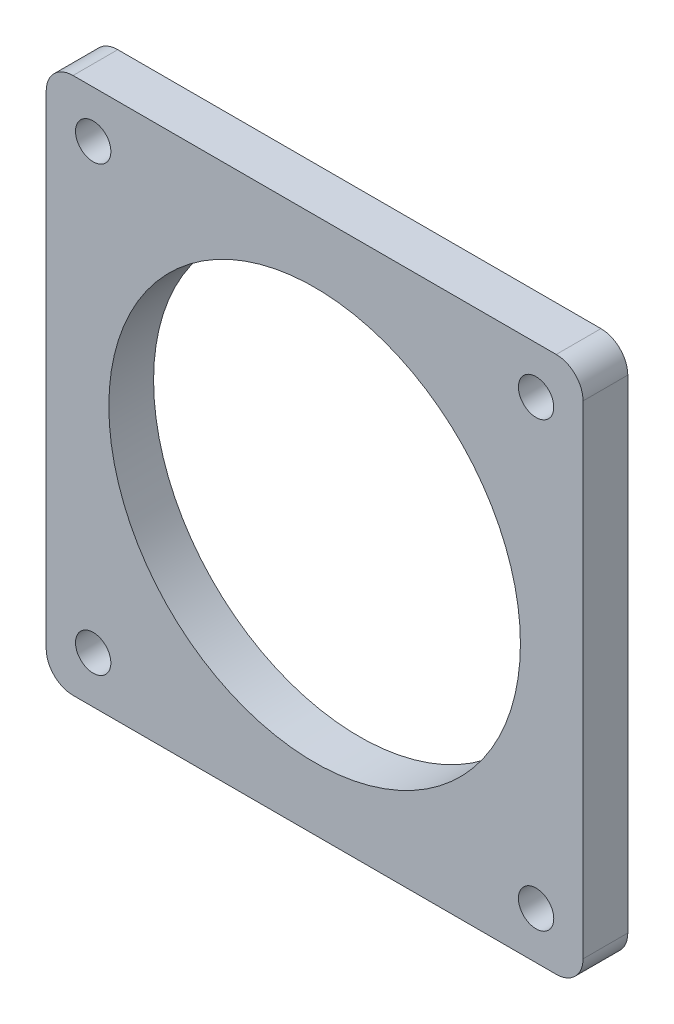
ISO-10303-21;
HEADER;
FILE_DESCRIPTION(('STEP AP214'),'2;1');
FILE_NAME('part.step','',(''),(''),'','','');
FILE_SCHEMA(('AUTOMOTIVE_DESIGN { 1 0 10303 214 1 1 1 1 }'));
ENDSEC;
DATA;
#1=APPLICATION_CONTEXT('core data for automotive mechanical design processes');
#2=APPLICATION_PROTOCOL_DEFINITION('international standard','automotive_design',2000,#1);
#3=PRODUCT_CONTEXT('',#1,'mechanical');
#4=PRODUCT('Part','Part','',(#3));
#5=PRODUCT_RELATED_PRODUCT_CATEGORY('part','',(#4));
#6=PRODUCT_DEFINITION_FORMATION('','',#4);
#7=PRODUCT_DEFINITION_CONTEXT('part definition',#1,'design');
#8=PRODUCT_DEFINITION('design','',#6,#7);
#9=PRODUCT_DEFINITION_SHAPE('','',#8);
#10=(LENGTH_UNIT() NAMED_UNIT(*) SI_UNIT(.MILLI.,.METRE.));
#11=(NAMED_UNIT(*) PLANE_ANGLE_UNIT() SI_UNIT($,.RADIAN.));
#12=(NAMED_UNIT(*) SI_UNIT($,.STERADIAN.) SOLID_ANGLE_UNIT());
#13=UNCERTAINTY_MEASURE_WITH_UNIT(LENGTH_MEASURE(1.E-05),#10,'distance_accuracy_value','');
#14=(GEOMETRIC_REPRESENTATION_CONTEXT(3) GLOBAL_UNCERTAINTY_ASSIGNED_CONTEXT((#13)) GLOBAL_UNIT_ASSIGNED_CONTEXT((#10,
#11,#12)) REPRESENTATION_CONTEXT('',''));
#15=CARTESIAN_POINT('',(0.,0.,0.));
#16=DIRECTION('',(0.,0.,1.));
#17=DIRECTION('',(1.,0.,0.));
#18=AXIS2_PLACEMENT_3D('',#15,#16,#17);
#19=CARTESIAN_POINT('',(27.,-27.,5.));
#20=DIRECTION('',(0.,0.,1.));
#21=DIRECTION('',(1.,0.,0.));
#22=AXIS2_PLACEMENT_3D('',#19,#20,#21);
#23=PLANE('',#22);
#24=CARTESIAN_POINT('',(24.75,-24.75,5.));
#25=DIRECTION('',(0.,0.,1.));
#26=DIRECTION('',(1.,0.,0.));
#27=AXIS2_PLACEMENT_3D('',#24,#25,#26);
#28=CIRCLE('',#27,1.975);
#29=CARTESIAN_POINT('',(26.725,-24.75,5.));
#30=VERTEX_POINT('',#29);
#31=EDGE_CURVE('E195',#30,#30,#28,.T.);
#32=ORIENTED_EDGE('',*,*,#31,.F.);
#33=EDGE_LOOP('',(#32));
#34=FACE_BOUND('',#33,.T.);
#35=CARTESIAN_POINT('',(-24.75,24.75,5.));
#36=DIRECTION('',(0.,0.,1.));
#37=DIRECTION('',(1.,0.,0.));
#38=AXIS2_PLACEMENT_3D('',#35,#36,#37);
#39=CIRCLE('',#38,1.975);
#40=CARTESIAN_POINT('',(-22.775,24.75,5.));
#41=VERTEX_POINT('',#40);
#42=EDGE_CURVE('E183',#41,#41,#39,.T.);
#43=ORIENTED_EDGE('',*,*,#42,.F.);
#44=EDGE_LOOP('',(#43));
#45=FACE_BOUND('',#44,.T.);
#46=CARTESIAN_POINT('',(27.,-27.,5.));
#47=DIRECTION('',(0.,0.,1.));
#48=DIRECTION('',(1.,0.,0.));
#49=AXIS2_PLACEMENT_3D('',#46,#47,#48);
#50=CIRCLE('',#49,3.);
#51=CARTESIAN_POINT('',(27.,-30.,5.));
#52=VERTEX_POINT('',#51);
#53=CARTESIAN_POINT('',(30.,-27.,5.));
#54=VERTEX_POINT('',#53);
#55=EDGE_CURVE('E146',#52,#54,#50,.T.);
#56=ORIENTED_EDGE('',*,*,#55,.T.);
#57=DIRECTION('',(0.,1.,0.));
#58=VECTOR('',#57,1.);
#59=CARTESIAN_POINT('',(30.,27.,5.));
#60=LINE('',#59,#58);
#61=CARTESIAN_POINT('',(30.,27.,5.));
#62=VERTEX_POINT('',#61);
#63=EDGE_CURVE('E94',#54,#62,#60,.T.);
#64=ORIENTED_EDGE('',*,*,#63,.T.);
#65=CARTESIAN_POINT('',(27.,27.,5.));
#66=DIRECTION('',(0.,0.,1.));
#67=DIRECTION('',(-1.,0.,0.));
#68=AXIS2_PLACEMENT_3D('',#65,#66,#67);
#69=CIRCLE('',#68,3.);
#70=CARTESIAN_POINT('',(27.,30.,5.));
#71=VERTEX_POINT('',#70);
#72=EDGE_CURVE('E161',#62,#71,#69,.T.);
#73=ORIENTED_EDGE('',*,*,#72,.T.);
#74=DIRECTION('',(-1.,0.,0.));
#75=VECTOR('',#74,1.);
#76=CARTESIAN_POINT('',(-27.,30.,5.));
#77=LINE('',#76,#75);
#78=CARTESIAN_POINT('',(-27.,30.,5.));
#79=VERTEX_POINT('',#78);
#80=EDGE_CURVE('E174',#71,#79,#77,.T.);
#81=ORIENTED_EDGE('',*,*,#80,.T.);
#82=CARTESIAN_POINT('',(-27.,27.,5.));
#83=DIRECTION('',(0.,0.,1.));
#84=DIRECTION('',(1.,0.,0.));
#85=AXIS2_PLACEMENT_3D('',#82,#83,#84);
#86=CIRCLE('',#85,3.);
#87=CARTESIAN_POINT('',(-30.,27.,5.));
#88=VERTEX_POINT('',#87);
#89=EDGE_CURVE('E113',#79,#88,#86,.T.);
#90=ORIENTED_EDGE('',*,*,#89,.T.);
#91=DIRECTION('',(0.,-1.,0.));
#92=VECTOR('',#91,1.);
#93=CARTESIAN_POINT('',(-30.,27.,5.));
#94=LINE('',#93,#92);
#95=CARTESIAN_POINT('',(-30.,-27.,5.));
#96=VERTEX_POINT('',#95);
#97=EDGE_CURVE('E107',#88,#96,#94,.T.);
#98=ORIENTED_EDGE('',*,*,#97,.T.);
#99=CARTESIAN_POINT('',(-27.,-27.,5.));
#100=DIRECTION('',(0.,0.,1.));
#101=DIRECTION('',(1.,0.,0.));
#102=AXIS2_PLACEMENT_3D('',#99,#100,#101);
#103=CIRCLE('',#102,3.);
#104=CARTESIAN_POINT('',(-27.,-30.,5.));
#105=VERTEX_POINT('',#104);
#106=EDGE_CURVE('E111',#96,#105,#103,.T.);
#107=ORIENTED_EDGE('',*,*,#106,.T.);
#108=DIRECTION('',(1.,0.,0.));
#109=VECTOR('',#108,1.);
#110=CARTESIAN_POINT('',(-27.,-30.,5.));
#111=LINE('',#110,#109);
#112=EDGE_CURVE('E51',#105,#52,#111,.T.);
#113=ORIENTED_EDGE('',*,*,#112,.T.);
#114=EDGE_LOOP('',(#56,#64,#73,#81,#90,#98,#107,#113));
#115=FACE_BOUND('',#114,.T.);
#116=CARTESIAN_POINT('',(0.,0.,5.));
#117=DIRECTION('',(0.,0.,1.));
#118=DIRECTION('',(1.,0.,0.));
#119=AXIS2_PLACEMENT_3D('',#116,#117,#118);
#120=CIRCLE('',#119,23.);
#121=CARTESIAN_POINT('',(23.,0.,5.));
#122=VERTEX_POINT('',#121);
#123=EDGE_CURVE('E135',#122,#122,#120,.T.);
#124=ORIENTED_EDGE('',*,*,#123,.F.);
#125=EDGE_LOOP('',(#124));
#126=FACE_BOUND('',#125,.T.);
#127=CARTESIAN_POINT('',(24.75,24.75,5.));
#128=DIRECTION('',(0.,0.,1.));
#129=DIRECTION('',(-1.,0.,0.));
#130=AXIS2_PLACEMENT_3D('',#127,#128,#129);
#131=CIRCLE('',#130,1.975);
#132=CARTESIAN_POINT('',(22.775,24.75,5.));
#133=VERTEX_POINT('',#132);
#134=EDGE_CURVE('E189',#133,#133,#131,.T.);
#135=ORIENTED_EDGE('',*,*,#134,.F.);
#136=EDGE_LOOP('',(#135));
#137=FACE_BOUND('',#136,.T.);
#138=CARTESIAN_POINT('',(-24.75,-24.75,5.));
#139=DIRECTION('',(0.,0.,1.));
#140=DIRECTION('',(-1.,0.,0.));
#141=AXIS2_PLACEMENT_3D('',#138,#139,#140);
#142=CIRCLE('',#141,1.975);
#143=CARTESIAN_POINT('',(-26.725,-24.75,5.));
#144=VERTEX_POINT('',#143);
#145=EDGE_CURVE('E201',#144,#144,#142,.T.);
#146=ORIENTED_EDGE('',*,*,#145,.F.);
#147=EDGE_LOOP('',(#146));
#148=FACE_BOUND('',#147,.T.);
#149=ADVANCED_FACE('F34',(#34,#45,#115,#126,#137,#148),#23,.T.);
#150=CARTESIAN_POINT('',(27.,-27.,0.));
#151=DIRECTION('',(0.,0.,1.));
#152=DIRECTION('',(1.,0.,0.));
#153=AXIS2_PLACEMENT_3D('',#150,#151,#152);
#154=PLANE('',#153);
#155=CARTESIAN_POINT('',(27.,-27.,0.));
#156=DIRECTION('',(0.,0.,1.));
#157=DIRECTION('',(1.,0.,0.));
#158=AXIS2_PLACEMENT_3D('',#155,#156,#157);
#159=CIRCLE('',#158,3.);
#160=CARTESIAN_POINT('',(27.,-30.,0.));
#161=VERTEX_POINT('',#160);
#162=CARTESIAN_POINT('',(30.,-27.,0.));
#163=VERTEX_POINT('',#162);
#164=EDGE_CURVE('E131',#161,#163,#159,.T.);
#165=ORIENTED_EDGE('',*,*,#164,.F.);
#166=DIRECTION('',(1.,0.,0.));
#167=VECTOR('',#166,1.);
#168=CARTESIAN_POINT('',(-27.,-30.,0.));
#169=LINE('',#168,#167);
#170=CARTESIAN_POINT('',(-27.,-30.,0.));
#171=VERTEX_POINT('',#170);
#172=EDGE_CURVE('E86',#171,#161,#169,.T.);
#173=ORIENTED_EDGE('',*,*,#172,.F.);
#174=CARTESIAN_POINT('',(-27.,-27.,0.));
#175=DIRECTION('',(0.,0.,1.));
#176=DIRECTION('',(1.,0.,0.));
#177=AXIS2_PLACEMENT_3D('',#174,#175,#176);
#178=CIRCLE('',#177,3.);
#179=CARTESIAN_POINT('',(-30.,-27.,0.));
#180=VERTEX_POINT('',#179);
#181=EDGE_CURVE('E80',#180,#171,#178,.T.);
#182=ORIENTED_EDGE('',*,*,#181,.F.);
#183=DIRECTION('',(0.,-1.,0.));
#184=VECTOR('',#183,1.);
#185=CARTESIAN_POINT('',(-30.,27.,0.));
#186=LINE('',#185,#184);
#187=CARTESIAN_POINT('',(-30.,27.,0.));
#188=VERTEX_POINT('',#187);
#189=EDGE_CURVE('E121',#188,#180,#186,.T.);
#190=ORIENTED_EDGE('',*,*,#189,.F.);
#191=CARTESIAN_POINT('',(-27.,27.,0.));
#192=DIRECTION('',(0.,0.,1.));
#193=DIRECTION('',(1.,0.,0.));
#194=AXIS2_PLACEMENT_3D('',#191,#192,#193);
#195=CIRCLE('',#194,3.);
#196=CARTESIAN_POINT('',(-27.,30.,0.));
#197=VERTEX_POINT('',#196);
#198=EDGE_CURVE('E141',#197,#188,#195,.T.);
#199=ORIENTED_EDGE('',*,*,#198,.F.);
#200=DIRECTION('',(-1.,0.,0.));
#201=VECTOR('',#200,1.);
#202=CARTESIAN_POINT('',(-27.,30.,0.));
#203=LINE('',#202,#201);
#204=CARTESIAN_POINT('',(27.,30.,0.));
#205=VERTEX_POINT('',#204);
#206=EDGE_CURVE('E139',#205,#197,#203,.T.);
#207=ORIENTED_EDGE('',*,*,#206,.F.);
#208=CARTESIAN_POINT('',(27.,27.,0.));
#209=DIRECTION('',(0.,0.,1.));
#210=DIRECTION('',(-1.,0.,0.));
#211=AXIS2_PLACEMENT_3D('',#208,#209,#210);
#212=CIRCLE('',#211,3.);
#213=CARTESIAN_POINT('',(30.,27.,0.));
#214=VERTEX_POINT('',#213);
#215=EDGE_CURVE('E137',#214,#205,#212,.T.);
#216=ORIENTED_EDGE('',*,*,#215,.F.);
#217=DIRECTION('',(0.,1.,0.));
#218=VECTOR('',#217,1.);
#219=CARTESIAN_POINT('',(30.,27.,0.));
#220=LINE('',#219,#218);
#221=EDGE_CURVE('E134',#163,#214,#220,.T.);
#222=ORIENTED_EDGE('',*,*,#221,.F.);
#223=EDGE_LOOP('',(#165,#173,#182,#190,#199,#207,#216,#222));
#224=FACE_BOUND('',#223,.T.);
#225=CARTESIAN_POINT('',(0.,0.,0.));
#226=DIRECTION('',(0.,0.,1.));
#227=DIRECTION('',(1.,0.,0.));
#228=AXIS2_PLACEMENT_3D('',#225,#226,#227);
#229=CIRCLE('',#228,23.);
#230=CARTESIAN_POINT('',(23.,0.,0.));
#231=VERTEX_POINT('',#230);
#232=EDGE_CURVE('E180',#231,#231,#229,.T.);
#233=ORIENTED_EDGE('',*,*,#232,.T.);
#234=EDGE_LOOP('',(#233));
#235=FACE_BOUND('',#234,.T.);
#236=CARTESIAN_POINT('',(-24.75,24.75,0.));
#237=DIRECTION('',(0.,0.,1.));
#238=DIRECTION('',(1.,0.,0.));
#239=AXIS2_PLACEMENT_3D('',#236,#237,#238);
#240=CIRCLE('',#239,1.975);
#241=CARTESIAN_POINT('',(-22.775,24.75,0.));
#242=VERTEX_POINT('',#241);
#243=EDGE_CURVE('E186',#242,#242,#240,.T.);
#244=ORIENTED_EDGE('',*,*,#243,.T.);
#245=EDGE_LOOP('',(#244));
#246=FACE_BOUND('',#245,.T.);
#247=CARTESIAN_POINT('',(24.75,24.75,0.));
#248=DIRECTION('',(0.,0.,1.));
#249=DIRECTION('',(-1.,0.,0.));
#250=AXIS2_PLACEMENT_3D('',#247,#248,#249);
#251=CIRCLE('',#250,1.975);
#252=CARTESIAN_POINT('',(22.775,24.75,0.));
#253=VERTEX_POINT('',#252);
#254=EDGE_CURVE('E192',#253,#253,#251,.T.);
#255=ORIENTED_EDGE('',*,*,#254,.T.);
#256=EDGE_LOOP('',(#255));
#257=FACE_BOUND('',#256,.T.);
#258=CARTESIAN_POINT('',(24.75,-24.75,0.));
#259=DIRECTION('',(0.,0.,1.));
#260=DIRECTION('',(1.,0.,0.));
#261=AXIS2_PLACEMENT_3D('',#258,#259,#260);
#262=CIRCLE('',#261,1.975);
#263=CARTESIAN_POINT('',(26.725,-24.75,0.));
#264=VERTEX_POINT('',#263);
#265=EDGE_CURVE('E198',#264,#264,#262,.T.);
#266=ORIENTED_EDGE('',*,*,#265,.T.);
#267=EDGE_LOOP('',(#266));
#268=FACE_BOUND('',#267,.T.);
#269=CARTESIAN_POINT('',(-24.75,-24.75,0.));
#270=DIRECTION('',(0.,0.,1.));
#271=DIRECTION('',(-1.,0.,0.));
#272=AXIS2_PLACEMENT_3D('',#269,#270,#271);
#273=CIRCLE('',#272,1.975);
#274=CARTESIAN_POINT('',(-26.725,-24.75,0.));
#275=VERTEX_POINT('',#274);
#276=EDGE_CURVE('E204',#275,#275,#273,.T.);
#277=ORIENTED_EDGE('',*,*,#276,.T.);
#278=EDGE_LOOP('',(#277));
#279=FACE_BOUND('',#278,.T.);
#280=ADVANCED_FACE('F165',(#224,#235,#246,#257,#268,#279),#154,.F.);
#281=CARTESIAN_POINT('',(27.,-27.,5.));
#282=DIRECTION('',(0.,0.,-1.));
#283=DIRECTION('',(-1.,0.,0.));
#284=AXIS2_PLACEMENT_3D('',#281,#282,#283);
#285=CYLINDRICAL_SURFACE('',#284,3.);
#286=ORIENTED_EDGE('',*,*,#164,.T.);
#287=DIRECTION('',(0.,0.,-1.));
#288=VECTOR('',#287,1.);
#289=CARTESIAN_POINT('',(30.,-27.,5.));
#290=LINE('',#289,#288);
#291=EDGE_CURVE('E11',#54,#163,#290,.T.);
#292=ORIENTED_EDGE('',*,*,#291,.F.);
#293=ORIENTED_EDGE('',*,*,#55,.F.);
#294=DIRECTION('',(0.,0.,-1.));
#295=VECTOR('',#294,1.);
#296=CARTESIAN_POINT('',(27.,-30.,5.));
#297=LINE('',#296,#295);
#298=EDGE_CURVE('E127',#52,#161,#297,.T.);
#299=ORIENTED_EDGE('',*,*,#298,.T.);
#300=EDGE_LOOP('',(#286,#292,#293,#299));
#301=FACE_BOUND('',#300,.T.);
#302=ADVANCED_FACE('F36',(#301),#285,.T.);
#303=CARTESIAN_POINT('',(30.,27.,5.));
#304=DIRECTION('',(-1.,0.,0.));
#305=DIRECTION('',(0.,-1.,0.));
#306=AXIS2_PLACEMENT_3D('',#303,#304,#305);
#307=PLANE('',#306);
#308=ORIENTED_EDGE('',*,*,#221,.T.);
#309=DIRECTION('',(0.,0.,-1.));
#310=VECTOR('',#309,1.);
#311=CARTESIAN_POINT('',(30.,27.,5.));
#312=LINE('',#311,#310);
#313=EDGE_CURVE('E43',#62,#214,#312,.T.);
#314=ORIENTED_EDGE('',*,*,#313,.F.);
#315=ORIENTED_EDGE('',*,*,#63,.F.);
#316=ORIENTED_EDGE('',*,*,#291,.T.);
#317=EDGE_LOOP('',(#308,#314,#315,#316));
#318=FACE_BOUND('',#317,.T.);
#319=ADVANCED_FACE('F238',(#318),#307,.F.);
#320=CARTESIAN_POINT('',(27.,27.,5.));
#321=DIRECTION('',(0.,0.,-1.));
#322=DIRECTION('',(-1.,0.,0.));
#323=AXIS2_PLACEMENT_3D('',#320,#321,#322);
#324=CYLINDRICAL_SURFACE('',#323,3.);
#325=ORIENTED_EDGE('',*,*,#215,.T.);
#326=DIRECTION('',(0.,0.,-1.));
#327=VECTOR('',#326,1.);
#328=CARTESIAN_POINT('',(27.,30.,5.));
#329=LINE('',#328,#327);
#330=EDGE_CURVE('E153',#71,#205,#329,.T.);
#331=ORIENTED_EDGE('',*,*,#330,.F.);
#332=ORIENTED_EDGE('',*,*,#72,.F.);
#333=ORIENTED_EDGE('',*,*,#313,.T.);
#334=EDGE_LOOP('',(#325,#331,#332,#333));
#335=FACE_BOUND('',#334,.T.);
#336=ADVANCED_FACE('F159',(#335),#324,.T.);
#337=CARTESIAN_POINT('',(-27.,30.,5.));
#338=DIRECTION('',(0.,-1.,0.));
#339=DIRECTION('',(0.,0.,-1.));
#340=AXIS2_PLACEMENT_3D('',#337,#338,#339);
#341=PLANE('',#340);
#342=ORIENTED_EDGE('',*,*,#206,.T.);
#343=DIRECTION('',(0.,0.,-1.));
#344=VECTOR('',#343,1.);
#345=CARTESIAN_POINT('',(-27.,30.,5.));
#346=LINE('',#345,#344);
#347=EDGE_CURVE('E150',#79,#197,#346,.T.);
#348=ORIENTED_EDGE('',*,*,#347,.F.);
#349=ORIENTED_EDGE('',*,*,#80,.F.);
#350=ORIENTED_EDGE('',*,*,#330,.T.);
#351=EDGE_LOOP('',(#342,#348,#349,#350));
#352=FACE_BOUND('',#351,.T.);
#353=ADVANCED_FACE('F170',(#352),#341,.F.);
#354=CARTESIAN_POINT('',(-27.,27.,5.));
#355=DIRECTION('',(0.,0.,-1.));
#356=DIRECTION('',(-1.,0.,0.));
#357=AXIS2_PLACEMENT_3D('',#354,#355,#356);
#358=CYLINDRICAL_SURFACE('',#357,3.);
#359=ORIENTED_EDGE('',*,*,#198,.T.);
#360=DIRECTION('',(0.,0.,-1.));
#361=VECTOR('',#360,1.);
#362=CARTESIAN_POINT('',(-30.,27.,5.));
#363=LINE('',#362,#361);
#364=EDGE_CURVE('E122',#88,#188,#363,.T.);
#365=ORIENTED_EDGE('',*,*,#364,.F.);
#366=ORIENTED_EDGE('',*,*,#89,.F.);
#367=ORIENTED_EDGE('',*,*,#347,.T.);
#368=EDGE_LOOP('',(#359,#365,#366,#367));
#369=FACE_BOUND('',#368,.T.);
#370=ADVANCED_FACE('F173',(#369),#358,.T.);
#371=CARTESIAN_POINT('',(-30.,27.,5.));
#372=DIRECTION('',(1.,0.,0.));
#373=DIRECTION('',(0.,1.,0.));
#374=AXIS2_PLACEMENT_3D('',#371,#372,#373);
#375=PLANE('',#374);
#376=ORIENTED_EDGE('',*,*,#189,.T.);
#377=DIRECTION('',(0.,0.,-1.));
#378=VECTOR('',#377,1.);
#379=CARTESIAN_POINT('',(-30.,-27.,5.));
#380=LINE('',#379,#378);
#381=EDGE_CURVE('E118',#96,#180,#380,.T.);
#382=ORIENTED_EDGE('',*,*,#381,.F.);
#383=ORIENTED_EDGE('',*,*,#97,.F.);
#384=ORIENTED_EDGE('',*,*,#364,.T.);
#385=EDGE_LOOP('',(#376,#382,#383,#384));
#386=FACE_BOUND('',#385,.T.);
#387=ADVANCED_FACE('F119',(#386),#375,.F.);
#388=CARTESIAN_POINT('',(-27.,-27.,5.));
#389=DIRECTION('',(0.,0.,-1.));
#390=DIRECTION('',(-1.,0.,0.));
#391=AXIS2_PLACEMENT_3D('',#388,#389,#390);
#392=CYLINDRICAL_SURFACE('',#391,3.);
#393=ORIENTED_EDGE('',*,*,#181,.T.);
#394=DIRECTION('',(0.,0.,-1.));
#395=VECTOR('',#394,1.);
#396=CARTESIAN_POINT('',(-27.,-30.,5.));
#397=LINE('',#396,#395);
#398=EDGE_CURVE('E123',#105,#171,#397,.T.);
#399=ORIENTED_EDGE('',*,*,#398,.F.);
#400=ORIENTED_EDGE('',*,*,#106,.F.);
#401=ORIENTED_EDGE('',*,*,#381,.T.);
#402=EDGE_LOOP('',(#393,#399,#400,#401));
#403=FACE_BOUND('',#402,.T.);
#404=ADVANCED_FACE('F125',(#403),#392,.T.);
#405=CARTESIAN_POINT('',(-27.,-30.,5.));
#406=DIRECTION('',(0.,1.,0.));
#407=DIRECTION('',(0.,0.,1.));
#408=AXIS2_PLACEMENT_3D('',#405,#406,#407);
#409=PLANE('',#408);
#410=ORIENTED_EDGE('',*,*,#172,.T.);
#411=ORIENTED_EDGE('',*,*,#298,.F.);
#412=ORIENTED_EDGE('',*,*,#112,.F.);
#413=ORIENTED_EDGE('',*,*,#398,.T.);
#414=EDGE_LOOP('',(#410,#411,#412,#413));
#415=FACE_BOUND('',#414,.T.);
#416=ADVANCED_FACE('F226',(#415),#409,.F.);
#417=CARTESIAN_POINT('',(0.,0.,5.));
#418=DIRECTION('',(0.,0.,-1.));
#419=DIRECTION('',(-1.,0.,0.));
#420=AXIS2_PLACEMENT_3D('',#417,#418,#419);
#421=CYLINDRICAL_SURFACE('',#420,23.);
#422=ORIENTED_EDGE('',*,*,#123,.T.);
#423=EDGE_LOOP('',(#422));
#424=FACE_BOUND('',#423,.T.);
#425=ORIENTED_EDGE('',*,*,#232,.F.);
#426=EDGE_LOOP('',(#425));
#427=FACE_BOUND('',#426,.T.);
#428=ADVANCED_FACE('F223',(#424,#427),#421,.F.);
#429=CARTESIAN_POINT('',(-24.75,24.75,5.));
#430=DIRECTION('',(0.,0.,-1.));
#431=DIRECTION('',(-1.,0.,0.));
#432=AXIS2_PLACEMENT_3D('',#429,#430,#431);
#433=CYLINDRICAL_SURFACE('',#432,1.975);
#434=ORIENTED_EDGE('',*,*,#42,.T.);
#435=EDGE_LOOP('',(#434));
#436=FACE_BOUND('',#435,.T.);
#437=ORIENTED_EDGE('',*,*,#243,.F.);
#438=EDGE_LOOP('',(#437));
#439=FACE_BOUND('',#438,.T.);
#440=ADVANCED_FACE('F303',(#436,#439),#433,.F.);
#441=CARTESIAN_POINT('',(24.75,24.75,5.));
#442=DIRECTION('',(0.,0.,-1.));
#443=DIRECTION('',(-1.,0.,0.));
#444=AXIS2_PLACEMENT_3D('',#441,#442,#443);
#445=CYLINDRICAL_SURFACE('',#444,1.975);
#446=ORIENTED_EDGE('',*,*,#134,.T.);
#447=EDGE_LOOP('',(#446));
#448=FACE_BOUND('',#447,.T.);
#449=ORIENTED_EDGE('',*,*,#254,.F.);
#450=EDGE_LOOP('',(#449));
#451=FACE_BOUND('',#450,.T.);
#452=ADVANCED_FACE('F311',(#448,#451),#445,.F.);
#453=CARTESIAN_POINT('',(24.75,-24.75,5.));
#454=DIRECTION('',(0.,0.,-1.));
#455=DIRECTION('',(-1.,0.,0.));
#456=AXIS2_PLACEMENT_3D('',#453,#454,#455);
#457=CYLINDRICAL_SURFACE('',#456,1.975);
#458=ORIENTED_EDGE('',*,*,#31,.T.);
#459=EDGE_LOOP('',(#458));
#460=FACE_BOUND('',#459,.T.);
#461=ORIENTED_EDGE('',*,*,#265,.F.);
#462=EDGE_LOOP('',(#461));
#463=FACE_BOUND('',#462,.T.);
#464=ADVANCED_FACE('F319',(#460,#463),#457,.F.);
#465=CARTESIAN_POINT('',(-24.75,-24.75,5.));
#466=DIRECTION('',(0.,0.,-1.));
#467=DIRECTION('',(-1.,0.,0.));
#468=AXIS2_PLACEMENT_3D('',#465,#466,#467);
#469=CYLINDRICAL_SURFACE('',#468,1.975);
#470=ORIENTED_EDGE('',*,*,#145,.T.);
#471=EDGE_LOOP('',(#470));
#472=FACE_BOUND('',#471,.T.);
#473=ORIENTED_EDGE('',*,*,#276,.F.);
#474=EDGE_LOOP('',(#473));
#475=FACE_BOUND('',#474,.T.);
#476=ADVANCED_FACE('F210',(#472,#475),#469,.F.);
#477=CLOSED_SHELL('',(#149,#280,#302,#319,#336,#353,#370,#387,#404,#416,#428,#440,#452,#464,#476));
#478=MANIFOLD_SOLID_BREP('B2',#477);
#479=ADVANCED_BREP_SHAPE_REPRESENTATION('',(#18,#478),#14);
#480=SHAPE_DEFINITION_REPRESENTATION(#9,#479);
ENDSEC;
END-ISO-10303-21;
